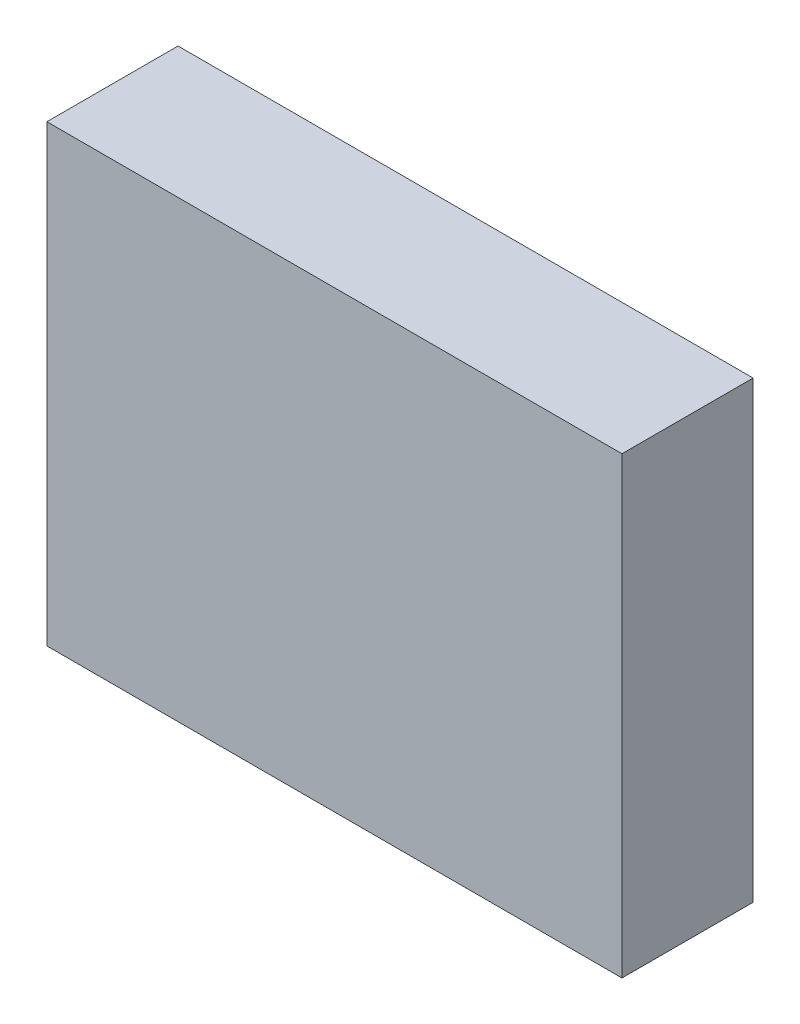
ISO-10303-21;
HEADER;
FILE_DESCRIPTION(('STEP AP214'),'2;1');
FILE_NAME('part.step','',(''),(''),'','','');
FILE_SCHEMA(('AUTOMOTIVE_DESIGN { 1 0 10303 214 1 1 1 1 }'));
ENDSEC;
DATA;
#1=APPLICATION_CONTEXT('core data for automotive mechanical design processes');
#2=APPLICATION_PROTOCOL_DEFINITION('international standard','automotive_design',2000,#1);
#3=PRODUCT_CONTEXT('',#1,'mechanical');
#4=PRODUCT('Part','Part','',(#3));
#5=PRODUCT_RELATED_PRODUCT_CATEGORY('part','',(#4));
#6=PRODUCT_DEFINITION_FORMATION('','',#4);
#7=PRODUCT_DEFINITION_CONTEXT('part definition',#1,'design');
#8=PRODUCT_DEFINITION('design','',#6,#7);
#9=PRODUCT_DEFINITION_SHAPE('','',#8);
#10=(LENGTH_UNIT() NAMED_UNIT(*) SI_UNIT(.MILLI.,.METRE.));
#11=(NAMED_UNIT(*) PLANE_ANGLE_UNIT() SI_UNIT($,.RADIAN.));
#12=(NAMED_UNIT(*) SI_UNIT($,.STERADIAN.) SOLID_ANGLE_UNIT());
#13=UNCERTAINTY_MEASURE_WITH_UNIT(LENGTH_MEASURE(1.E-05),#10,'distance_accuracy_value','');
#14=(GEOMETRIC_REPRESENTATION_CONTEXT(3) GLOBAL_UNCERTAINTY_ASSIGNED_CONTEXT((#13)) GLOBAL_UNIT_ASSIGNED_CONTEXT((#10,
#11,#12)) REPRESENTATION_CONTEXT('',''));
#15=CARTESIAN_POINT('',(0.,0.,0.));
#16=DIRECTION('',(0.,0.,1.));
#17=DIRECTION('',(1.,0.,0.));
#18=AXIS2_PLACEMENT_3D('',#15,#16,#17);
#19=CARTESIAN_POINT('',(-1.754251,-1.384935,0.80000094));
#20=DIRECTION('',(0.,0.,1.));
#21=DIRECTION('',(1.,0.,0.));
#22=AXIS2_PLACEMENT_3D('',#19,#20,#21);
#23=PLANE('',#22);
#24=DIRECTION('',(1.,0.,0.));
#25=VECTOR('',#24,1.);
#26=CARTESIAN_POINT('',(-1.754251,1.384935,0.80000094));
#27=LINE('',#26,#25);
#28=CARTESIAN_POINT('',(-1.754251,1.384935,0.80000094));
#29=VERTEX_POINT('',#28);
#30=CARTESIAN_POINT('',(1.754251,1.384935,0.80000094));
#31=VERTEX_POINT('',#30);
#32=EDGE_CURVE('E53',#29,#31,#27,.T.);
#33=ORIENTED_EDGE('',*,*,#32,.F.);
#34=DIRECTION('',(0.,1.,0.));
#35=VECTOR('',#34,1.);
#36=CARTESIAN_POINT('',(-1.754251,-1.384935,0.80000094));
#37=LINE('',#36,#35);
#38=CARTESIAN_POINT('',(-1.754251,-1.384935,0.80000094));
#39=VERTEX_POINT('',#38);
#40=EDGE_CURVE('E68',#39,#29,#37,.T.);
#41=ORIENTED_EDGE('',*,*,#40,.F.);
#42=DIRECTION('',(1.,0.,0.));
#43=VECTOR('',#42,1.);
#44=CARTESIAN_POINT('',(1.754251,-1.384935,0.80000094));
#45=LINE('',#44,#43);
#46=CARTESIAN_POINT('',(1.754251,-1.384935,0.80000094));
#47=VERTEX_POINT('',#46);
#48=EDGE_CURVE('E20',#47,#39,#45,.F.);
#49=ORIENTED_EDGE('',*,*,#48,.F.);
#50=DIRECTION('',(0.,1.,0.));
#51=VECTOR('',#50,1.);
#52=CARTESIAN_POINT('',(1.754251,1.384935,0.80000094));
#53=LINE('',#52,#51);
#54=EDGE_CURVE('E58',#31,#47,#53,.F.);
#55=ORIENTED_EDGE('',*,*,#54,.F.);
#56=EDGE_LOOP('',(#33,#41,#49,#55));
#57=FACE_BOUND('',#56,.T.);
#58=ADVANCED_FACE('F17',(#57),#23,.T.);
#59=CARTESIAN_POINT('',(1.754251,-1.384935,0.));
#60=DIRECTION('',(0.,-1.,0.));
#61=DIRECTION('',(0.,0.,-1.));
#62=AXIS2_PLACEMENT_3D('',#59,#60,#61);
#63=PLANE('',#62);
#64=DIRECTION('',(0.,0.,1.));
#65=VECTOR('',#64,1.);
#66=CARTESIAN_POINT('',(-1.754251,-1.384935,0.));
#67=LINE('',#66,#65);
#68=CARTESIAN_POINT('',(-1.754251,-1.384935,0.));
#69=VERTEX_POINT('',#68);
#70=EDGE_CURVE('E79',#69,#39,#67,.T.);
#71=ORIENTED_EDGE('',*,*,#70,.F.);
#72=DIRECTION('',(1.,0.,0.));
#73=VECTOR('',#72,1.);
#74=CARTESIAN_POINT('',(-1.754251,-1.384935,0.));
#75=LINE('',#74,#73);
#76=CARTESIAN_POINT('',(1.754251,-1.384935,0.));
#77=VERTEX_POINT('',#76);
#78=EDGE_CURVE('E74',#69,#77,#75,.T.);
#79=ORIENTED_EDGE('',*,*,#78,.T.);
#80=DIRECTION('',(0.,0.,-1.));
#81=VECTOR('',#80,1.);
#82=CARTESIAN_POINT('',(1.754251,-1.384935,0.));
#83=LINE('',#82,#81);
#84=EDGE_CURVE('E63',#47,#77,#83,.T.);
#85=ORIENTED_EDGE('',*,*,#84,.F.);
#86=ORIENTED_EDGE('',*,*,#48,.T.);
#87=EDGE_LOOP('',(#71,#79,#85,#86));
#88=FACE_BOUND('',#87,.T.);
#89=ADVANCED_FACE('F73',(#88),#63,.T.);
#90=CARTESIAN_POINT('',(1.754251,1.384935,0.));
#91=DIRECTION('',(1.,0.,0.));
#92=DIRECTION('',(0.,0.,-1.));
#93=AXIS2_PLACEMENT_3D('',#90,#91,#92);
#94=PLANE('',#93);
#95=ORIENTED_EDGE('',*,*,#84,.T.);
#96=DIRECTION('',(0.,1.,0.));
#97=VECTOR('',#96,1.);
#98=CARTESIAN_POINT('',(1.754251,-1.384935,0.));
#99=LINE('',#98,#97);
#100=CARTESIAN_POINT('',(1.754251,1.384935,0.));
#101=VERTEX_POINT('',#100);
#102=EDGE_CURVE('E84',#77,#101,#99,.T.);
#103=ORIENTED_EDGE('',*,*,#102,.T.);
#104=DIRECTION('',(0.,0.,1.));
#105=VECTOR('',#104,1.);
#106=CARTESIAN_POINT('',(1.754251,1.384935,0.));
#107=LINE('',#106,#105);
#108=EDGE_CURVE('E65',#31,#101,#107,.F.);
#109=ORIENTED_EDGE('',*,*,#108,.F.);
#110=ORIENTED_EDGE('',*,*,#54,.T.);
#111=EDGE_LOOP('',(#95,#103,#109,#110));
#112=FACE_BOUND('',#111,.T.);
#113=ADVANCED_FACE('F60',(#112),#94,.T.);
#114=CARTESIAN_POINT('',(-1.754251,1.384935,0.));
#115=DIRECTION('',(0.,1.,0.));
#116=DIRECTION('',(0.,0.,1.));
#117=AXIS2_PLACEMENT_3D('',#114,#115,#116);
#118=PLANE('',#117);
#119=ORIENTED_EDGE('',*,*,#108,.T.);
#120=DIRECTION('',(1.,0.,0.));
#121=VECTOR('',#120,1.);
#122=CARTESIAN_POINT('',(-1.754251,1.384935,0.));
#123=LINE('',#122,#121);
#124=CARTESIAN_POINT('',(-1.754251,1.384935,0.));
#125=VERTEX_POINT('',#124);
#126=EDGE_CURVE('E26',#101,#125,#123,.F.);
#127=ORIENTED_EDGE('',*,*,#126,.T.);
#128=DIRECTION('',(0.,0.,1.));
#129=VECTOR('',#128,1.);
#130=CARTESIAN_POINT('',(-1.754251,1.384935,0.));
#131=LINE('',#130,#129);
#132=EDGE_CURVE('E34',#29,#125,#131,.F.);
#133=ORIENTED_EDGE('',*,*,#132,.F.);
#134=ORIENTED_EDGE('',*,*,#32,.T.);
#135=EDGE_LOOP('',(#119,#127,#133,#134));
#136=FACE_BOUND('',#135,.T.);
#137=ADVANCED_FACE('F88',(#136),#118,.T.);
#138=CARTESIAN_POINT('',(-1.754251,-1.384935,0.));
#139=DIRECTION('',(-1.,0.,0.));
#140=DIRECTION('',(0.,0.,1.));
#141=AXIS2_PLACEMENT_3D('',#138,#139,#140);
#142=PLANE('',#141);
#143=ORIENTED_EDGE('',*,*,#132,.T.);
#144=DIRECTION('',(0.,1.,0.));
#145=VECTOR('',#144,1.);
#146=CARTESIAN_POINT('',(-1.754251,-1.384935,0.));
#147=LINE('',#146,#145);
#148=EDGE_CURVE('E11',#125,#69,#147,.F.);
#149=ORIENTED_EDGE('',*,*,#148,.T.);
#150=ORIENTED_EDGE('',*,*,#70,.T.);
#151=ORIENTED_EDGE('',*,*,#40,.T.);
#152=EDGE_LOOP('',(#143,#149,#150,#151));
#153=FACE_BOUND('',#152,.T.);
#154=ADVANCED_FACE('F91',(#153),#142,.T.);
#155=CARTESIAN_POINT('',(-1.754251,-1.384935,0.));
#156=DIRECTION('',(0.,0.,1.));
#157=DIRECTION('',(1.,0.,0.));
#158=AXIS2_PLACEMENT_3D('',#155,#156,#157);
#159=PLANE('',#158);
#160=ORIENTED_EDGE('',*,*,#126,.F.);
#161=ORIENTED_EDGE('',*,*,#102,.F.);
#162=ORIENTED_EDGE('',*,*,#78,.F.);
#163=ORIENTED_EDGE('',*,*,#148,.F.);
#164=EDGE_LOOP('',(#160,#161,#162,#163));
#165=FACE_BOUND('',#164,.T.);
#166=ADVANCED_FACE('F90',(#165),#159,.F.);
#167=CLOSED_SHELL('',(#58,#89,#113,#137,#154,#166));
#168=MANIFOLD_SOLID_BREP('B1',#167);
#169=ADVANCED_BREP_SHAPE_REPRESENTATION('',(#18,#168),#14);
#170=SHAPE_DEFINITION_REPRESENTATION(#9,#169);
ENDSEC;
END-ISO-10303-21;
